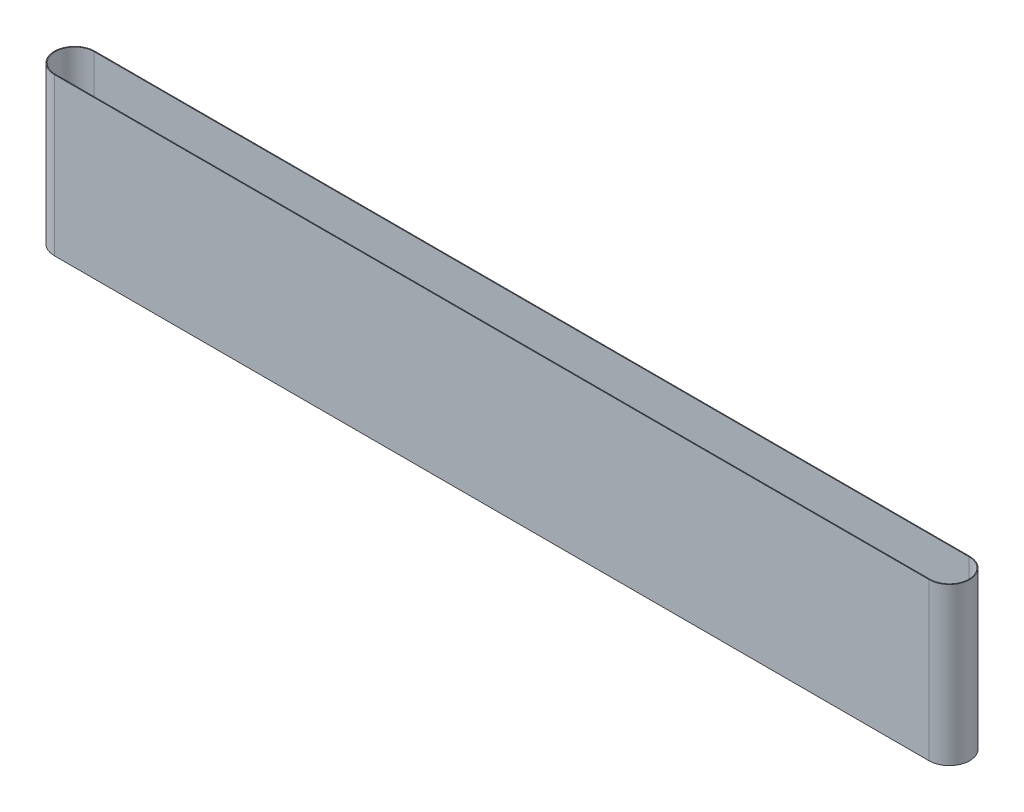
ISO-10303-21;
HEADER;
FILE_DESCRIPTION(('STEP AP214'),'2;1');
FILE_NAME('part.step','',(''),(''),'','','');
FILE_SCHEMA(('AUTOMOTIVE_DESIGN { 1 0 10303 214 1 1 1 1 }'));
ENDSEC;
DATA;
#1=APPLICATION_CONTEXT('core data for automotive mechanical design processes');
#2=APPLICATION_PROTOCOL_DEFINITION('international standard','automotive_design',2000,#1);
#3=PRODUCT_CONTEXT('',#1,'mechanical');
#4=PRODUCT('Part','Part','',(#3));
#5=PRODUCT_RELATED_PRODUCT_CATEGORY('part','',(#4));
#6=PRODUCT_DEFINITION_FORMATION('','',#4);
#7=PRODUCT_DEFINITION_CONTEXT('part definition',#1,'design');
#8=PRODUCT_DEFINITION('design','',#6,#7);
#9=PRODUCT_DEFINITION_SHAPE('','',#8);
#10=(LENGTH_UNIT() NAMED_UNIT(*) SI_UNIT(.MILLI.,.METRE.));
#11=(NAMED_UNIT(*) PLANE_ANGLE_UNIT() SI_UNIT($,.RADIAN.));
#12=(NAMED_UNIT(*) SI_UNIT($,.STERADIAN.) SOLID_ANGLE_UNIT());
#13=UNCERTAINTY_MEASURE_WITH_UNIT(LENGTH_MEASURE(1.E-05),#10,'distance_accuracy_value','');
#14=(GEOMETRIC_REPRESENTATION_CONTEXT(3) GLOBAL_UNCERTAINTY_ASSIGNED_CONTEXT((#13)) GLOBAL_UNIT_ASSIGNED_CONTEXT((#10,
#11,#12)) REPRESENTATION_CONTEXT('',''));
#15=CARTESIAN_POINT('',(0.,0.,0.));
#16=DIRECTION('',(0.,0.,1.));
#17=DIRECTION('',(1.,0.,0.));
#18=AXIS2_PLACEMENT_3D('',#15,#16,#17);
#19=CARTESIAN_POINT('',(-71.1248885872688,205.,-13.3951873506023));
#20=DIRECTION('',(0.,1.,0.));
#21=DIRECTION('',(0.,0.,1.));
#22=AXIS2_PLACEMENT_3D('',#19,#20,#21);
#23=PLANE('',#22);
#24=CARTESIAN_POINT('',(-71.1248885872688,205.,-13.3951873506023));
#25=DIRECTION('',(0.,1.,0.));
#26=DIRECTION('',(1.,0.,0.));
#27=AXIS2_PLACEMENT_3D('',#24,#25,#26);
#28=CIRCLE('',#27,26.5);
#29=CARTESIAN_POINT('',(-71.1248885872688,205.,-39.8951873506023));
#30=VERTEX_POINT('',#29);
#31=CARTESIAN_POINT('',(-71.1248885872688,205.,13.1048126493977));
#32=VERTEX_POINT('',#31);
#33=EDGE_CURVE('E155',#30,#32,#28,.T.);
#34=ORIENTED_EDGE('',*,*,#33,.T.);
#35=DIRECTION('',(1.,0.,0.));
#36=VECTOR('',#35,1.);
#37=CARTESIAN_POINT('',(-71.1248885872688,205.,13.1048126493977));
#38=LINE('',#37,#36);
#39=CARTESIAN_POINT('',(1071.67511141273,205.,13.1048126493977));
#40=VERTEX_POINT('',#39);
#41=EDGE_CURVE('E158',#32,#40,#38,.T.);
#42=ORIENTED_EDGE('',*,*,#41,.T.);
#43=CARTESIAN_POINT('',(1071.67511141273,205.,-13.3951873506023));
#44=DIRECTION('',(0.,1.,0.));
#45=DIRECTION('',(1.,0.,0.));
#46=AXIS2_PLACEMENT_3D('',#43,#44,#45);
#47=CIRCLE('',#46,26.5);
#48=CARTESIAN_POINT('',(1071.67511141273,205.,-39.8951873506023));
#49=VERTEX_POINT('',#48);
#50=EDGE_CURVE('E161',#40,#49,#47,.T.);
#51=ORIENTED_EDGE('',*,*,#50,.T.);
#52=DIRECTION('',(-1.,0.,0.));
#53=VECTOR('',#52,1.);
#54=CARTESIAN_POINT('',(-71.1248885872688,205.,-39.8951873506023));
#55=LINE('',#54,#53);
#56=EDGE_CURVE('E163',#49,#30,#55,.T.);
#57=ORIENTED_EDGE('',*,*,#56,.T.);
#58=EDGE_LOOP('',(#34,#42,#51,#57));
#59=FACE_BOUND('',#58,.T.);
#60=DIRECTION('',(1.,0.,0.));
#61=VECTOR('',#60,1.);
#62=CARTESIAN_POINT('',(-71.1248885872688,205.,12.1048126493977));
#63=LINE('',#62,#61);
#64=CARTESIAN_POINT('',(-71.1248885872688,205.,12.1048126493977));
#65=VERTEX_POINT('',#64);
#66=CARTESIAN_POINT('',(1071.67511141273,205.,12.1048126493977));
#67=VERTEX_POINT('',#66);
#68=EDGE_CURVE('E127',#65,#67,#63,.T.);
#69=ORIENTED_EDGE('',*,*,#68,.F.);
#70=CARTESIAN_POINT('',(-71.1248885872688,205.,-13.3951873506023));
#71=DIRECTION('',(0.,1.,0.));
#72=DIRECTION('',(0.,0.,1.));
#73=AXIS2_PLACEMENT_3D('',#70,#71,#72);
#74=CIRCLE('',#73,25.5);
#75=CARTESIAN_POINT('',(-71.1248885872688,205.,-38.8951873506023));
#76=VERTEX_POINT('',#75);
#77=EDGE_CURVE('E119',#76,#65,#74,.T.);
#78=ORIENTED_EDGE('',*,*,#77,.F.);
#79=DIRECTION('',(-1.,0.,0.));
#80=VECTOR('',#79,1.);
#81=CARTESIAN_POINT('',(-71.1248885872688,205.,-38.8951873506023));
#82=LINE('',#81,#80);
#83=CARTESIAN_POINT('',(1071.67511141273,205.,-38.8951873506023));
#84=VERTEX_POINT('',#83);
#85=EDGE_CURVE('E141',#84,#76,#82,.T.);
#86=ORIENTED_EDGE('',*,*,#85,.F.);
#87=CARTESIAN_POINT('',(1071.67511141273,205.,-13.3951873506023));
#88=DIRECTION('',(0.,1.,0.));
#89=DIRECTION('',(0.,0.,1.));
#90=AXIS2_PLACEMENT_3D('',#87,#88,#89);
#91=CIRCLE('',#90,25.5);
#92=EDGE_CURVE('E139',#67,#84,#91,.T.);
#93=ORIENTED_EDGE('',*,*,#92,.F.);
#94=EDGE_LOOP('',(#69,#78,#86,#93));
#95=FACE_BOUND('',#94,.T.);
#96=ADVANCED_FACE('F54',(#59,#95),#23,.T.);
#97=CARTESIAN_POINT('',(-71.1248885872688,0.,-13.3951873506023));
#98=DIRECTION('',(0.,1.,0.));
#99=DIRECTION('',(0.,0.,1.));
#100=AXIS2_PLACEMENT_3D('',#97,#98,#99);
#101=PLANE('',#100);
#102=CARTESIAN_POINT('',(-71.1248885872688,0.,-13.3951873506023));
#103=DIRECTION('',(0.,1.,0.));
#104=DIRECTION('',(1.,0.,0.));
#105=AXIS2_PLACEMENT_3D('',#102,#103,#104);
#106=CIRCLE('',#105,26.5);
#107=CARTESIAN_POINT('',(-71.1248885872688,0.,-39.8951873506023));
#108=VERTEX_POINT('',#107);
#109=CARTESIAN_POINT('',(-71.1248885872688,0.,13.1048126493977));
#110=VERTEX_POINT('',#109);
#111=EDGE_CURVE('E135',#108,#110,#106,.T.);
#112=ORIENTED_EDGE('',*,*,#111,.F.);
#113=DIRECTION('',(-1.,0.,0.));
#114=VECTOR('',#113,1.);
#115=CARTESIAN_POINT('',(-71.1248885872688,0.,-39.8951873506023));
#116=LINE('',#115,#114);
#117=CARTESIAN_POINT('',(1071.67511141273,0.,-39.8951873506023));
#118=VERTEX_POINT('',#117);
#119=EDGE_CURVE('E159',#118,#108,#116,.T.);
#120=ORIENTED_EDGE('',*,*,#119,.F.);
#121=CARTESIAN_POINT('',(1071.67511141273,0.,-13.3951873506023));
#122=DIRECTION('',(0.,1.,0.));
#123=DIRECTION('',(1.,0.,0.));
#124=AXIS2_PLACEMENT_3D('',#121,#122,#123);
#125=CIRCLE('',#124,26.5);
#126=CARTESIAN_POINT('',(1071.67511141273,0.,13.1048126493977));
#127=VERTEX_POINT('',#126);
#128=EDGE_CURVE('E170',#127,#118,#125,.T.);
#129=ORIENTED_EDGE('',*,*,#128,.F.);
#130=DIRECTION('',(1.,0.,0.));
#131=VECTOR('',#130,1.);
#132=CARTESIAN_POINT('',(-71.1248885872688,0.,13.1048126493977));
#133=LINE('',#132,#131);
#134=EDGE_CURVE('E168',#110,#127,#133,.T.);
#135=ORIENTED_EDGE('',*,*,#134,.F.);
#136=EDGE_LOOP('',(#112,#120,#129,#135));
#137=FACE_BOUND('',#136,.T.);
#138=CARTESIAN_POINT('',(-71.1248885872688,0.,-13.3951873506023));
#139=DIRECTION('',(0.,1.,0.));
#140=DIRECTION('',(0.,0.,1.));
#141=AXIS2_PLACEMENT_3D('',#138,#139,#140);
#142=CIRCLE('',#141,25.5);
#143=CARTESIAN_POINT('',(-71.1248885872688,0.,-38.8951873506023));
#144=VERTEX_POINT('',#143);
#145=CARTESIAN_POINT('',(-71.1248885872688,0.,12.1048126493977));
#146=VERTEX_POINT('',#145);
#147=EDGE_CURVE('E77',#144,#146,#142,.T.);
#148=ORIENTED_EDGE('',*,*,#147,.T.);
#149=DIRECTION('',(1.,0.,0.));
#150=VECTOR('',#149,1.);
#151=CARTESIAN_POINT('',(-71.1248885872688,0.,12.1048126493977));
#152=LINE('',#151,#150);
#153=CARTESIAN_POINT('',(1071.67511141273,0.,12.1048126493977));
#154=VERTEX_POINT('',#153);
#155=EDGE_CURVE('E134',#146,#154,#152,.T.);
#156=ORIENTED_EDGE('',*,*,#155,.T.);
#157=CARTESIAN_POINT('',(1071.67511141273,0.,-13.3951873506023));
#158=DIRECTION('',(0.,1.,0.));
#159=DIRECTION('',(0.,0.,1.));
#160=AXIS2_PLACEMENT_3D('',#157,#158,#159);
#161=CIRCLE('',#160,25.5);
#162=CARTESIAN_POINT('',(1071.67511141273,0.,-38.8951873506023));
#163=VERTEX_POINT('',#162);
#164=EDGE_CURVE('E147',#154,#163,#161,.T.);
#165=ORIENTED_EDGE('',*,*,#164,.T.);
#166=DIRECTION('',(-1.,0.,0.));
#167=VECTOR('',#166,1.);
#168=CARTESIAN_POINT('',(-71.1248885872688,0.,-38.8951873506023));
#169=LINE('',#168,#167);
#170=EDGE_CURVE('E128',#163,#144,#169,.T.);
#171=ORIENTED_EDGE('',*,*,#170,.T.);
#172=EDGE_LOOP('',(#148,#156,#165,#171));
#173=FACE_BOUND('',#172,.T.);
#174=ADVANCED_FACE('F188',(#137,#173),#101,.F.);
#175=CARTESIAN_POINT('',(-71.1248885872688,205.,-13.3951873506023));
#176=DIRECTION('',(0.,-1.,0.));
#177=DIRECTION('',(0.,0.,-1.));
#178=AXIS2_PLACEMENT_3D('',#175,#176,#177);
#179=CYLINDRICAL_SURFACE('',#178,26.5);
#180=ORIENTED_EDGE('',*,*,#111,.T.);
#181=DIRECTION('',(0.,-1.,0.));
#182=VECTOR('',#181,1.);
#183=CARTESIAN_POINT('',(-71.1248885872688,205.,13.1048126493977));
#184=LINE('',#183,#182);
#185=EDGE_CURVE('E12',#32,#110,#184,.T.);
#186=ORIENTED_EDGE('',*,*,#185,.F.);
#187=ORIENTED_EDGE('',*,*,#33,.F.);
#188=DIRECTION('',(0.,-1.,0.));
#189=VECTOR('',#188,1.);
#190=CARTESIAN_POINT('',(-71.1248885872688,205.,-39.8951873506023));
#191=LINE('',#190,#189);
#192=EDGE_CURVE('E165',#30,#108,#191,.T.);
#193=ORIENTED_EDGE('',*,*,#192,.T.);
#194=EDGE_LOOP('',(#180,#186,#187,#193));
#195=FACE_BOUND('',#194,.T.);
#196=ADVANCED_FACE('F56',(#195),#179,.T.);
#197=CARTESIAN_POINT('',(-71.1248885872688,205.,13.1048126493977));
#198=DIRECTION('',(0.,0.,-1.));
#199=DIRECTION('',(-1.,0.,0.));
#200=AXIS2_PLACEMENT_3D('',#197,#198,#199);
#201=PLANE('',#200);
#202=ORIENTED_EDGE('',*,*,#134,.T.);
#203=DIRECTION('',(0.,-1.,0.));
#204=VECTOR('',#203,1.);
#205=CARTESIAN_POINT('',(1071.67511141273,205.,13.1048126493977));
#206=LINE('',#205,#204);
#207=EDGE_CURVE('E62',#40,#127,#206,.T.);
#208=ORIENTED_EDGE('',*,*,#207,.F.);
#209=ORIENTED_EDGE('',*,*,#41,.F.);
#210=ORIENTED_EDGE('',*,*,#185,.T.);
#211=EDGE_LOOP('',(#202,#208,#209,#210));
#212=FACE_BOUND('',#211,.T.);
#213=ADVANCED_FACE('F198',(#212),#201,.F.);
#214=CARTESIAN_POINT('',(1071.67511141273,205.,-13.3951873506023));
#215=DIRECTION('',(0.,-1.,0.));
#216=DIRECTION('',(0.,0.,-1.));
#217=AXIS2_PLACEMENT_3D('',#214,#215,#216);
#218=CYLINDRICAL_SURFACE('',#217,26.5);
#219=ORIENTED_EDGE('',*,*,#128,.T.);
#220=DIRECTION('',(0.,-1.,0.));
#221=VECTOR('',#220,1.);
#222=CARTESIAN_POINT('',(1071.67511141273,205.,-39.8951873506023));
#223=LINE('',#222,#221);
#224=EDGE_CURVE('E175',#49,#118,#223,.T.);
#225=ORIENTED_EDGE('',*,*,#224,.F.);
#226=ORIENTED_EDGE('',*,*,#50,.F.);
#227=ORIENTED_EDGE('',*,*,#207,.T.);
#228=EDGE_LOOP('',(#219,#225,#226,#227));
#229=FACE_BOUND('',#228,.T.);
#230=ADVANCED_FACE('F182',(#229),#218,.T.);
#231=CARTESIAN_POINT('',(-71.1248885872688,205.,-39.8951873506023));
#232=DIRECTION('',(0.,0.,1.));
#233=DIRECTION('',(1.,0.,0.));
#234=AXIS2_PLACEMENT_3D('',#231,#232,#233);
#235=PLANE('',#234);
#236=ORIENTED_EDGE('',*,*,#119,.T.);
#237=ORIENTED_EDGE('',*,*,#192,.F.);
#238=ORIENTED_EDGE('',*,*,#56,.F.);
#239=ORIENTED_EDGE('',*,*,#224,.T.);
#240=EDGE_LOOP('',(#236,#237,#238,#239));
#241=FACE_BOUND('',#240,.T.);
#242=ADVANCED_FACE('F192',(#241),#235,.F.);
#243=CARTESIAN_POINT('',(-71.1248885872688,205.,-13.3951873506023));
#244=DIRECTION('',(0.,-1.,0.));
#245=DIRECTION('',(0.,0.,-1.));
#246=AXIS2_PLACEMENT_3D('',#243,#244,#245);
#247=CYLINDRICAL_SURFACE('',#246,25.5);
#248=ORIENTED_EDGE('',*,*,#147,.F.);
#249=DIRECTION('',(0.,-1.,0.));
#250=VECTOR('',#249,1.);
#251=CARTESIAN_POINT('',(-71.1248885872688,205.,-38.8951873506023));
#252=LINE('',#251,#250);
#253=EDGE_CURVE('E123',#76,#144,#252,.T.);
#254=ORIENTED_EDGE('',*,*,#253,.F.);
#255=ORIENTED_EDGE('',*,*,#77,.T.);
#256=DIRECTION('',(0.,-1.,0.));
#257=VECTOR('',#256,1.);
#258=CARTESIAN_POINT('',(-71.1248885872688,205.,12.1048126493977));
#259=LINE('',#258,#257);
#260=EDGE_CURVE('E122',#65,#146,#259,.T.);
#261=ORIENTED_EDGE('',*,*,#260,.T.);
#262=EDGE_LOOP('',(#248,#254,#255,#261));
#263=FACE_BOUND('',#262,.T.);
#264=ADVANCED_FACE('F121',(#263),#247,.F.);
#265=CARTESIAN_POINT('',(-71.1248885872688,205.,12.1048126493977));
#266=DIRECTION('',(0.,0.,-1.));
#267=DIRECTION('',(-1.,0.,0.));
#268=AXIS2_PLACEMENT_3D('',#265,#266,#267);
#269=PLANE('',#268);
#270=ORIENTED_EDGE('',*,*,#155,.F.);
#271=ORIENTED_EDGE('',*,*,#260,.F.);
#272=ORIENTED_EDGE('',*,*,#68,.T.);
#273=DIRECTION('',(0.,-1.,0.));
#274=VECTOR('',#273,1.);
#275=CARTESIAN_POINT('',(1071.67511141273,205.,12.1048126493977));
#276=LINE('',#275,#274);
#277=EDGE_CURVE('E136',#67,#154,#276,.T.);
#278=ORIENTED_EDGE('',*,*,#277,.T.);
#279=EDGE_LOOP('',(#270,#271,#272,#278));
#280=FACE_BOUND('',#279,.T.);
#281=ADVANCED_FACE('F131',(#280),#269,.T.);
#282=CARTESIAN_POINT('',(1071.67511141273,205.,-13.3951873506023));
#283=DIRECTION('',(0.,-1.,0.));
#284=DIRECTION('',(0.,0.,-1.));
#285=AXIS2_PLACEMENT_3D('',#282,#283,#284);
#286=CYLINDRICAL_SURFACE('',#285,25.5);
#287=ORIENTED_EDGE('',*,*,#164,.F.);
#288=ORIENTED_EDGE('',*,*,#277,.F.);
#289=ORIENTED_EDGE('',*,*,#92,.T.);
#290=DIRECTION('',(0.,-1.,0.));
#291=VECTOR('',#290,1.);
#292=CARTESIAN_POINT('',(1071.67511141273,205.,-38.8951873506023));
#293=LINE('',#292,#291);
#294=EDGE_CURVE('E69',#84,#163,#293,.T.);
#295=ORIENTED_EDGE('',*,*,#294,.T.);
#296=EDGE_LOOP('',(#287,#288,#289,#295));
#297=FACE_BOUND('',#296,.T.);
#298=ADVANCED_FACE('F221',(#297),#286,.F.);
#299=CARTESIAN_POINT('',(-71.1248885872688,205.,-38.8951873506023));
#300=DIRECTION('',(0.,0.,1.));
#301=DIRECTION('',(1.,0.,0.));
#302=AXIS2_PLACEMENT_3D('',#299,#300,#301);
#303=PLANE('',#302);
#304=ORIENTED_EDGE('',*,*,#170,.F.);
#305=ORIENTED_EDGE('',*,*,#294,.F.);
#306=ORIENTED_EDGE('',*,*,#85,.T.);
#307=ORIENTED_EDGE('',*,*,#253,.T.);
#308=EDGE_LOOP('',(#304,#305,#306,#307));
#309=FACE_BOUND('',#308,.T.);
#310=ADVANCED_FACE('F225',(#309),#303,.T.);
#311=CLOSED_SHELL('',(#96,#174,#196,#213,#230,#242,#264,#281,#298,#310));
#312=MANIFOLD_SOLID_BREP('B2',#311);
#313=ADVANCED_BREP_SHAPE_REPRESENTATION('',(#18,#312),#14);
#314=SHAPE_DEFINITION_REPRESENTATION(#9,#313);
ENDSEC;
END-ISO-10303-21;
